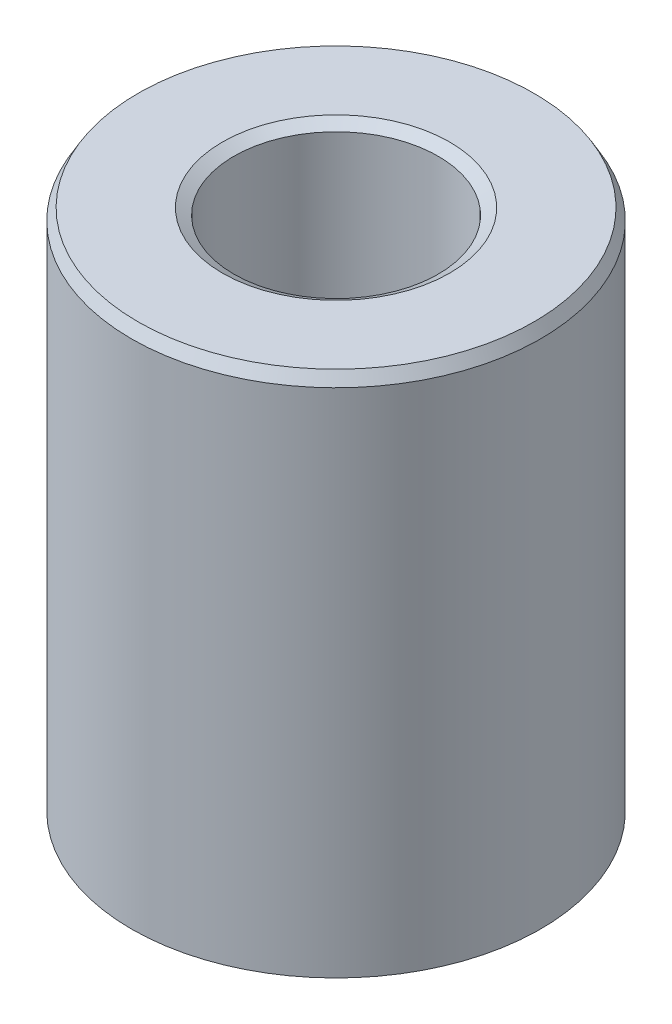
ISO-10303-21;
HEADER;
FILE_DESCRIPTION(('STEP AP214'),'2;1');
FILE_NAME('part.step','',(''),(''),'','','');
FILE_SCHEMA(('AUTOMOTIVE_DESIGN { 1 0 10303 214 1 1 1 1 }'));
ENDSEC;
DATA;
#1=APPLICATION_CONTEXT('core data for automotive mechanical design processes');
#2=APPLICATION_PROTOCOL_DEFINITION('international standard','automotive_design',2000,#1);
#3=PRODUCT_CONTEXT('',#1,'mechanical');
#4=PRODUCT('Part','Part','',(#3));
#5=PRODUCT_RELATED_PRODUCT_CATEGORY('part','',(#4));
#6=PRODUCT_DEFINITION_FORMATION('','',#4);
#7=PRODUCT_DEFINITION_CONTEXT('part definition',#1,'design');
#8=PRODUCT_DEFINITION('design','',#6,#7);
#9=PRODUCT_DEFINITION_SHAPE('','',#8);
#10=(LENGTH_UNIT() NAMED_UNIT(*) SI_UNIT(.MILLI.,.METRE.));
#11=(NAMED_UNIT(*) PLANE_ANGLE_UNIT() SI_UNIT($,.RADIAN.));
#12=(NAMED_UNIT(*) SI_UNIT($,.STERADIAN.) SOLID_ANGLE_UNIT());
#13=UNCERTAINTY_MEASURE_WITH_UNIT(LENGTH_MEASURE(1.E-05),#10,'distance_accuracy_value','');
#14=(GEOMETRIC_REPRESENTATION_CONTEXT(3) GLOBAL_UNCERTAINTY_ASSIGNED_CONTEXT((#13)) GLOBAL_UNIT_ASSIGNED_CONTEXT((#10,
#11,#12)) REPRESENTATION_CONTEXT('',''));
#15=CARTESIAN_POINT('',(0.,0.,0.));
#16=DIRECTION('',(0.,0.,1.));
#17=DIRECTION('',(1.,0.,0.));
#18=AXIS2_PLACEMENT_3D('',#15,#16,#17);
#19=CARTESIAN_POINT('',(0.,148.734454820492,0.));
#20=DIRECTION('',(0.,-1.,0.));
#21=DIRECTION('',(0.,0.,-1.));
#22=AXIS2_PLACEMENT_3D('',#19,#20,#21);
#23=CYLINDRICAL_SURFACE('',#22,57.5);
#24=CARTESIAN_POINT('',(0.,1.85324450187971,0.));
#25=DIRECTION('',(0.,1.,0.));
#26=DIRECTION('',(0.,0.,1.));
#27=AXIS2_PLACEMENT_3D('',#24,#25,#26);
#28=CIRCLE('',#27,57.5);
#29=CARTESIAN_POINT('',(0.,1.85324450187971,57.5));
#30=VERTEX_POINT('',#29);
#31=EDGE_CURVE('E10',#30,#30,#28,.T.);
#32=ORIENTED_EDGE('',*,*,#31,.T.);
#33=EDGE_LOOP('',(#32));
#34=FACE_BOUND('',#33,.T.);
#35=CARTESIAN_POINT('',(0.,145.524541184389,0.));
#36=DIRECTION('',(0.,1.,0.));
#37=DIRECTION('',(0.,0.,1.));
#38=AXIS2_PLACEMENT_3D('',#35,#36,#37);
#39=CIRCLE('',#38,57.5);
#40=CARTESIAN_POINT('',(0.,145.524541184389,57.5));
#41=VERTEX_POINT('',#40);
#42=EDGE_CURVE('E50',#41,#41,#39,.F.);
#43=ORIENTED_EDGE('',*,*,#42,.T.);
#44=EDGE_LOOP('',(#43));
#45=FACE_BOUND('',#44,.T.);
#46=ADVANCED_FACE('F39',(#34,#45),#23,.T.);
#47=CARTESIAN_POINT('',(0.,148.734454820492,0.));
#48=DIRECTION('',(0.,1.,0.));
#49=DIRECTION('',(0.,0.,1.));
#50=AXIS2_PLACEMENT_3D('',#47,#48,#49);
#51=PLANE('',#50);
#52=CARTESIAN_POINT('',(0.,148.734454820492,0.));
#53=DIRECTION('',(0.,1.,0.));
#54=DIRECTION('',(0.,0.,1.));
#55=AXIS2_PLACEMENT_3D('',#52,#53,#54);
#56=CIRCLE('',#55,31.9331600181575);
#57=CARTESIAN_POINT('',(0.,148.734454820492,31.9331600181575));
#58=VERTEX_POINT('',#57);
#59=EDGE_CURVE('E58',#58,#58,#56,.F.);
#60=ORIENTED_EDGE('',*,*,#59,.T.);
#61=EDGE_LOOP('',(#60));
#62=FACE_BOUND('',#61,.T.);
#63=CARTESIAN_POINT('',(0.,148.734454820492,0.));
#64=DIRECTION('',(0.,1.,0.));
#65=DIRECTION('',(0.,0.,1.));
#66=AXIS2_PLACEMENT_3D('',#63,#64,#65);
#67=CIRCLE('',#66,55.6467554981202);
#68=CARTESIAN_POINT('',(0.,148.734454820492,55.6467554981202));
#69=VERTEX_POINT('',#68);
#70=EDGE_CURVE('E61',#69,#69,#67,.T.);
#71=ORIENTED_EDGE('',*,*,#70,.T.);
#72=EDGE_LOOP('',(#71));
#73=FACE_BOUND('',#72,.T.);
#74=ADVANCED_FACE('F88',(#62,#73),#51,.T.);
#75=CARTESIAN_POINT('',(0.,0.,0.));
#76=DIRECTION('',(0.,1.,0.));
#77=DIRECTION('',(0.,0.,1.));
#78=AXIS2_PLACEMENT_3D('',#75,#76,#77);
#79=PLANE('',#78);
#80=CARTESIAN_POINT('',(0.,0.,0.));
#81=DIRECTION('',(0.,1.,0.));
#82=DIRECTION('',(0.,0.,1.));
#83=AXIS2_PLACEMENT_3D('',#80,#81,#82);
#84=CIRCLE('',#83,30.5764908839338);
#85=CARTESIAN_POINT('',(0.,0.,30.5764908839338));
#86=VERTEX_POINT('',#85);
#87=EDGE_CURVE('E51',#86,#86,#84,.T.);
#88=ORIENTED_EDGE('',*,*,#87,.T.);
#89=EDGE_LOOP('',(#88));
#90=FACE_BOUND('',#89,.T.);
#91=CARTESIAN_POINT('',(0.,0.,0.));
#92=DIRECTION('',(0.,1.,0.));
#93=DIRECTION('',(0.,0.,1.));
#94=AXIS2_PLACEMENT_3D('',#91,#92,#93);
#95=CIRCLE('',#94,54.2900863638966);
#96=CARTESIAN_POINT('',(0.,0.,54.2900863638966));
#97=VERTEX_POINT('',#96);
#98=EDGE_CURVE('E54',#97,#97,#95,.F.);
#99=ORIENTED_EDGE('',*,*,#98,.T.);
#100=EDGE_LOOP('',(#99));
#101=FACE_BOUND('',#100,.T.);
#102=ADVANCED_FACE('F83',(#90,#101),#79,.F.);
#103=CARTESIAN_POINT('',(0.,148.734454820492,0.));
#104=DIRECTION('',(0.,-1.,0.));
#105=DIRECTION('',(0.,0.,-1.));
#106=AXIS2_PLACEMENT_3D('',#103,#104,#105);
#107=CYLINDRICAL_SURFACE('',#106,28.7232463820541);
#108=CARTESIAN_POINT('',(0.,146.881210318612,0.));
#109=DIRECTION('',(0.,1.,0.));
#110=DIRECTION('',(0.,0.,1.));
#111=AXIS2_PLACEMENT_3D('',#108,#109,#110);
#112=CIRCLE('',#111,28.7232463820541);
#113=CARTESIAN_POINT('',(0.,146.881210318612,28.723246382054));
#114=VERTEX_POINT('',#113);
#115=EDGE_CURVE('E67',#114,#114,#112,.T.);
#116=ORIENTED_EDGE('',*,*,#115,.T.);
#117=EDGE_LOOP('',(#116));
#118=FACE_BOUND('',#117,.T.);
#119=CARTESIAN_POINT('',(0.,3.2099136361034,0.));
#120=DIRECTION('',(0.,1.,0.));
#121=DIRECTION('',(0.,0.,1.));
#122=AXIS2_PLACEMENT_3D('',#119,#120,#121);
#123=CIRCLE('',#122,28.7232463820541);
#124=CARTESIAN_POINT('',(0.,3.2099136361034,28.7232463820541));
#125=VERTEX_POINT('',#124);
#126=EDGE_CURVE('E69',#125,#125,#123,.F.);
#127=ORIENTED_EDGE('',*,*,#126,.T.);
#128=EDGE_LOOP('',(#127));
#129=FACE_BOUND('',#128,.T.);
#130=ADVANCED_FACE('F71',(#118,#129),#107,.F.);
#131=CARTESIAN_POINT('',(0.,146.881210318612,0.));
#132=DIRECTION('',(0.,1.,0.));
#133=DIRECTION('',(0.,0.,1.));
#134=AXIS2_PLACEMENT_3D('',#131,#132,#133);
#135=CONICAL_SURFACE('',#134,28.7232463820541,1.0471975511966);
#136=CARTESIAN_POINT('',(0.,148.734454820492,31.9331600181575));
#137=CARTESIAN_POINT('',(0.,148.715150190264,31.8997234177814));
#138=CARTESIAN_POINT('',(0.,148.695845560036,31.8662868174053));
#139=CARTESIAN_POINT('',(0.,148.65723629958,31.7994136166532));
#140=CARTESIAN_POINT('',(0.,148.637931669352,31.7659770162771));
#141=CARTESIAN_POINT('',(0.,148.599322408897,31.6991038155249));
#142=CARTESIAN_POINT('',(0.,148.580017778669,31.6656672151489));
#143=CARTESIAN_POINT('',(0.,148.541408518213,31.5987940143967));
#144=CARTESIAN_POINT('',(0.,148.522103887985,31.5653574140206));
#145=CARTESIAN_POINT('',(0.,148.483494627529,31.4984842132685));
#146=CARTESIAN_POINT('',(0.,148.464189997301,31.4650476128924));
#147=CARTESIAN_POINT('',(0.,148.425580736845,31.3981744121402));
#148=CARTESIAN_POINT('',(0.,148.406276106617,31.3647378117642));
#149=CARTESIAN_POINT('',(0.,148.367666846162,31.297864611012));
#150=CARTESIAN_POINT('',(0.,148.348362215934,31.2644280106359));
#151=CARTESIAN_POINT('',(0.,148.309752955478,31.1975548098838));
#152=CARTESIAN_POINT('',(0.,148.29044832525,31.1641182095077));
#153=CARTESIAN_POINT('',(0.,148.251839064794,31.0972450087555));
#154=CARTESIAN_POINT('',(0.,148.232534434566,31.0638084083795));
#155=CARTESIAN_POINT('',(0.,148.19392517411,30.9969352076273));
#156=CARTESIAN_POINT('',(0.,148.174620543882,30.9634986072512));
#157=CARTESIAN_POINT('',(0.,148.136011283427,30.8966254064991));
#158=CARTESIAN_POINT('',(0.,148.116706653199,30.863188806123));
#159=CARTESIAN_POINT('',(0.,148.078097392743,30.7963156053708));
#160=CARTESIAN_POINT('',(0.,148.058792762515,30.7628790049948));
#161=CARTESIAN_POINT('',(0.,148.020183502059,30.6960058042426));
#162=CARTESIAN_POINT('',(0.,148.000878871831,30.6625692038665));
#163=CARTESIAN_POINT('',(0.,147.962269611375,30.5956960031144));
#164=CARTESIAN_POINT('',(0.,147.942964981147,30.5622594027383));
#165=CARTESIAN_POINT('',(0.,147.904355720692,30.4953862019861));
#166=CARTESIAN_POINT('',(0.,147.885051090464,30.4619496016101));
#167=CARTESIAN_POINT('',(0.,147.846441830008,30.3950764008579));
#168=CARTESIAN_POINT('',(0.,147.82713719978,30.3616398004818));
#169=CARTESIAN_POINT('',(0.,147.788527939324,30.2947665997297));
#170=CARTESIAN_POINT('',(0.,147.769223309096,30.2613299993536));
#171=CARTESIAN_POINT('',(0.,147.73061404864,30.1944567986014));
#172=CARTESIAN_POINT('',(0.,147.711309418413,30.1610201982254));
#173=CARTESIAN_POINT('',(0.,147.672700157957,30.0941469974732));
#174=CARTESIAN_POINT('',(0.,147.653395527729,30.0607103970971));
#175=CARTESIAN_POINT('',(0.,147.614786267273,29.993837196345));
#176=CARTESIAN_POINT('',(0.,147.595481637045,29.9604005959689));
#177=CARTESIAN_POINT('',(0.,147.556872376589,29.8935273952168));
#178=CARTESIAN_POINT('',(0.,147.537567746361,29.8600907948407));
#179=CARTESIAN_POINT('',(0.,147.498958485905,29.7932175940885));
#180=CARTESIAN_POINT('',(0.,147.479653855678,29.7597809937124));
#181=CARTESIAN_POINT('',(0.,147.441044595222,29.6929077929603));
#182=CARTESIAN_POINT('',(0.,147.421739964994,29.6594711925842));
#183=CARTESIAN_POINT('',(0.,147.383130704538,29.5925979918321));
#184=CARTESIAN_POINT('',(0.,147.36382607431,29.559161391456));
#185=CARTESIAN_POINT('',(0.,147.325216813854,29.4922881907038));
#186=CARTESIAN_POINT('',(0.,147.305912183626,29.4588515903277));
#187=CARTESIAN_POINT('',(0.,147.26730292317,29.3919783895756));
#188=CARTESIAN_POINT('',(0.,147.247998292943,29.3585417891995));
#189=CARTESIAN_POINT('',(0.,147.209389032487,29.2916685884474));
#190=CARTESIAN_POINT('',(0.,147.190084402259,29.2582319880713));
#191=CARTESIAN_POINT('',(0.,147.151475141803,29.1913587873191));
#192=CARTESIAN_POINT('',(0.,147.132170511575,29.157922186943));
#193=CARTESIAN_POINT('',(0.,147.093561251119,29.0910489861909));
#194=CARTESIAN_POINT('',(0.,147.074256620891,29.0576123858148));
#195=CARTESIAN_POINT('',(0.,147.035647360436,28.9907391850627));
#196=CARTESIAN_POINT('',(0.,147.016342730208,28.9573025846866));
#197=CARTESIAN_POINT('',(0.,146.977733469752,28.8904293839344));
#198=CARTESIAN_POINT('',(0.,146.958428839524,28.8569927835584));
#199=CARTESIAN_POINT('',(0.,146.919819579068,28.7901195828062));
#200=CARTESIAN_POINT('',(0.,146.90051494884,28.7566829824301));
#201=CARTESIAN_POINT('',(0.,146.881210318612,28.723246382054));
#202=B_SPLINE_CURVE_WITH_KNOTS('',3,(#136,#137,#138,#139,#140,#141,#142,#143,#144,#145,#146,
#147,#148,#149,#150,#151,#152,#153,#154,#155,#156,#157,#158,#159,#160,#161,#162,#163,#164,#165,
#166,#167,#168,#169,#170,#171,#172,#173,#174,#175,#176,#177,#178,#179,#180,#181,#182,#183,#184,
#185,#186,#187,#188,#189,#190,#191,#192,#193,#194,#195,#196,#197,#198,#199,#200,#201),
.UNSPECIFIED.,.F.,.F.,(4,2,2,2,2,2,2,2,2,2,2,2,2,2,2,2,2,2,2,2,2,2,2,2,2,2,2,2,2,2,2,2,4),(0.,
0.11582778136748,0.231655562734965,0.347483344102451,0.463311125469936,0.579138906837422,
0.694966688204908,0.81079446957239,0.926622250939876,1.04245003230736,1.15827781367484,
1.27410559504233,1.38993337640982,1.5057611577773,1.62158893914478,1.73741672051227,
1.85324450187975,1.96907228324724,2.08490006461472,2.20072784598221,2.31655562734969,
2.43238340871718,2.54821119008466,2.66403897145215,2.77986675281963,2.89569453418712,
3.0115223155546,3.12735009692209,3.24317787828957,3.35900565965706,3.47483344102454,
3.59066122239203,3.70648900375951),.UNSPECIFIED.);
#203=EDGE_CURVE('BSEAM77',#58,#114,#202,.T.);
#204=ORIENTED_EDGE('',*,*,#59,.F.);
#205=ORIENTED_EDGE('',*,*,#115,.F.);
#206=ORIENTED_EDGE('',*,*,#203,.T.);
#207=ORIENTED_EDGE('',*,*,#203,.F.);
#208=EDGE_LOOP('',(#204,#206,#205,#207));
#209=FACE_BOUND('',#208,.T.);
#210=ADVANCED_FACE('F77',(#209),#135,.F.);
#211=CARTESIAN_POINT('',(0.,0.,0.));
#212=DIRECTION('',(0.,-1.,0.));
#213=DIRECTION('',(0.,0.,-1.));
#214=AXIS2_PLACEMENT_3D('',#211,#212,#213);
#215=CONICAL_SURFACE('',#214,30.5764908839338,0.523598775598292);
#216=ORIENTED_EDGE('',*,*,#126,.F.);
#217=EDGE_LOOP('',(#216));
#218=FACE_BOUND('',#217,.T.);
#219=ORIENTED_EDGE('',*,*,#87,.F.);
#220=EDGE_LOOP('',(#219));
#221=FACE_BOUND('',#220,.T.);
#222=ADVANCED_FACE('F73',(#218,#221),#215,.F.);
#223=CARTESIAN_POINT('',(0.,1.85324450187971,0.));
#224=DIRECTION('',(0.,1.,0.));
#225=DIRECTION('',(0.,0.,1.));
#226=AXIS2_PLACEMENT_3D('',#223,#224,#225);
#227=CONICAL_SURFACE('',#226,57.5,1.04719755119661);
#228=ORIENTED_EDGE('',*,*,#98,.F.);
#229=EDGE_LOOP('',(#228));
#230=FACE_BOUND('',#229,.T.);
#231=ORIENTED_EDGE('',*,*,#31,.F.);
#232=EDGE_LOOP('',(#231));
#233=FACE_BOUND('',#232,.T.);
#234=ADVANCED_FACE('F76',(#230,#233),#227,.T.);
#235=CARTESIAN_POINT('',(0.,148.734454820492,0.));
#236=DIRECTION('',(0.,-1.,0.));
#237=DIRECTION('',(0.,0.,-1.));
#238=AXIS2_PLACEMENT_3D('',#235,#236,#237);
#239=CONICAL_SURFACE('',#238,55.6467554981202,0.523598775598301);
#240=ORIENTED_EDGE('',*,*,#42,.F.);
#241=EDGE_LOOP('',(#240));
#242=FACE_BOUND('',#241,.T.);
#243=ORIENTED_EDGE('',*,*,#70,.F.);
#244=EDGE_LOOP('',(#243));
#245=FACE_BOUND('',#244,.T.);
#246=ADVANCED_FACE('F45',(#242,#245),#239,.T.);
#247=CLOSED_SHELL('',(#46,#74,#102,#130,#210,#222,#234,#246));
#248=MANIFOLD_SOLID_BREP('B2',#247);
#249=ADVANCED_BREP_SHAPE_REPRESENTATION('',(#18,#248),#14);
#250=SHAPE_DEFINITION_REPRESENTATION(#9,#249);
ENDSEC;
END-ISO-10303-21;
